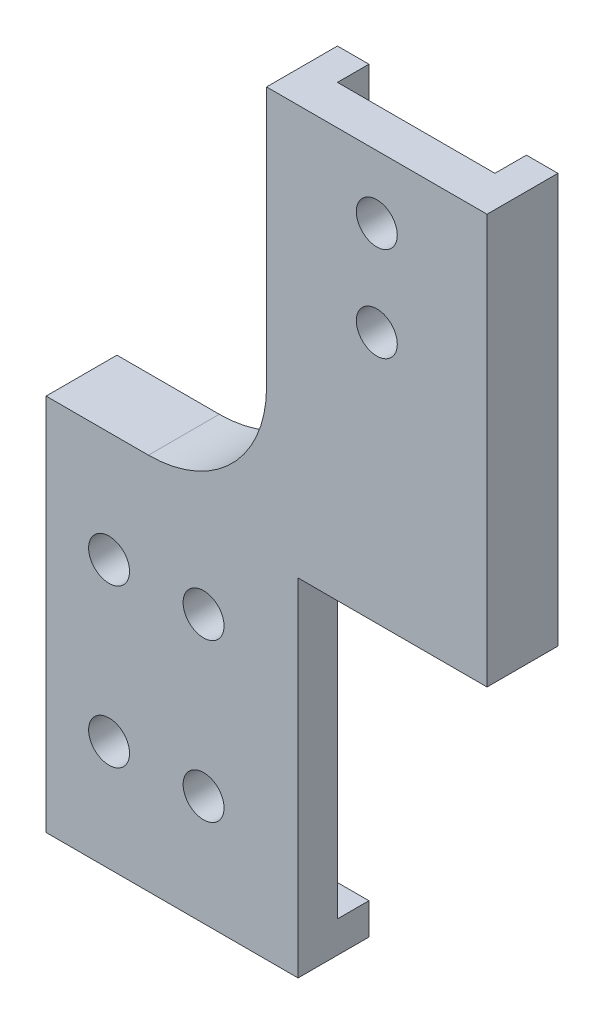
ISO-10303-21;
HEADER;
FILE_DESCRIPTION(('STEP AP214'),'2;1');
FILE_NAME('part.step','',(''),(''),'','','');
FILE_SCHEMA(('AUTOMOTIVE_DESIGN { 1 0 10303 214 1 1 1 1 }'));
ENDSEC;
DATA;
#1=APPLICATION_CONTEXT('core data for automotive mechanical design processes');
#2=APPLICATION_PROTOCOL_DEFINITION('international standard','automotive_design',2000,#1);
#3=PRODUCT_CONTEXT('',#1,'mechanical');
#4=PRODUCT('Part','Part','',(#3));
#5=PRODUCT_RELATED_PRODUCT_CATEGORY('part','',(#4));
#6=PRODUCT_DEFINITION_FORMATION('','',#4);
#7=PRODUCT_DEFINITION_CONTEXT('part definition',#1,'design');
#8=PRODUCT_DEFINITION('design','',#6,#7);
#9=PRODUCT_DEFINITION_SHAPE('','',#8);
#10=(LENGTH_UNIT() NAMED_UNIT(*) SI_UNIT(.MILLI.,.METRE.));
#11=(NAMED_UNIT(*) PLANE_ANGLE_UNIT() SI_UNIT($,.RADIAN.));
#12=(NAMED_UNIT(*) SI_UNIT($,.STERADIAN.) SOLID_ANGLE_UNIT());
#13=UNCERTAINTY_MEASURE_WITH_UNIT(LENGTH_MEASURE(1.E-05),#10,'distance_accuracy_value','');
#14=(GEOMETRIC_REPRESENTATION_CONTEXT(3) GLOBAL_UNCERTAINTY_ASSIGNED_CONTEXT((#13)) GLOBAL_UNIT_ASSIGNED_CONTEXT((#10,
#11,#12)) REPRESENTATION_CONTEXT('',''));
#15=CARTESIAN_POINT('',(0.,0.,0.));
#16=DIRECTION('',(0.,0.,1.));
#17=DIRECTION('',(1.,0.,0.));
#18=AXIS2_PLACEMENT_3D('',#15,#16,#17);
#19=CARTESIAN_POINT('',(0.,0.,0.));
#20=DIRECTION('',(0.,0.,1.));
#21=DIRECTION('',(1.,0.,0.));
#22=AXIS2_PLACEMENT_3D('',#19,#20,#21);
#23=PLANE('',#22);
#24=CARTESIAN_POINT('',(-19.1632335340545,-2.51071338522602,0.));
#25=DIRECTION('',(0.,0.,1.));
#26=DIRECTION('',(1.,0.,0.));
#27=AXIS2_PLACEMENT_3D('',#24,#25,#26);
#28=CIRCLE('',#27,2.6);
#29=CARTESIAN_POINT('',(-16.5632335340545,-2.51071338522602,0.));
#30=VERTEX_POINT('',#29);
#31=EDGE_CURVE('E219',#30,#30,#28,.T.);
#32=ORIENTED_EDGE('',*,*,#31,.T.);
#33=EDGE_LOOP('',(#32));
#34=FACE_BOUND('',#33,.T.);
#35=CARTESIAN_POINT('',(-31.1632335340545,-2.51071338522602,0.));
#36=DIRECTION('',(0.,0.,1.));
#37=DIRECTION('',(1.,0.,0.));
#38=AXIS2_PLACEMENT_3D('',#35,#36,#37);
#39=CIRCLE('',#38,2.6);
#40=CARTESIAN_POINT('',(-28.5632335340545,-2.51071338522602,0.));
#41=VERTEX_POINT('',#40);
#42=EDGE_CURVE('E258',#41,#41,#39,.T.);
#43=ORIENTED_EDGE('',*,*,#42,.T.);
#44=EDGE_LOOP('',(#43));
#45=FACE_BOUND('',#44,.T.);
#46=CARTESIAN_POINT('',(-19.1632335340545,-22.510713385226,0.));
#47=DIRECTION('',(0.,0.,1.));
#48=DIRECTION('',(1.,0.,0.));
#49=AXIS2_PLACEMENT_3D('',#46,#47,#48);
#50=CIRCLE('',#49,2.6);
#51=CARTESIAN_POINT('',(-16.5632335340545,-22.510713385226,0.));
#52=VERTEX_POINT('',#51);
#53=EDGE_CURVE('E267',#52,#52,#50,.T.);
#54=ORIENTED_EDGE('',*,*,#53,.T.);
#55=EDGE_LOOP('',(#54));
#56=FACE_BOUND('',#55,.T.);
#57=CARTESIAN_POINT('',(-31.1632335340545,-22.510713385226,0.));
#58=DIRECTION('',(0.,0.,1.));
#59=DIRECTION('',(1.,0.,0.));
#60=AXIS2_PLACEMENT_3D('',#57,#58,#59);
#61=CIRCLE('',#60,2.6);
#62=CARTESIAN_POINT('',(-28.5632335340545,-22.510713385226,0.));
#63=VERTEX_POINT('',#62);
#64=EDGE_CURVE('E270',#63,#63,#61,.T.);
#65=ORIENTED_EDGE('',*,*,#64,.T.);
#66=EDGE_LOOP('',(#65));
#67=FACE_BOUND('',#66,.T.);
#68=DIRECTION('',(1.,0.,0.));
#69=VECTOR('',#68,1.);
#70=CARTESIAN_POINT('',(0.,-32.510713385226,0.));
#71=LINE('',#70,#69);
#72=CARTESIAN_POINT('',(-39.1632335340545,-32.510713385226,0.));
#73=VERTEX_POINT('',#72);
#74=CARTESIAN_POINT('',(-7.16323353405451,-32.510713385226,0.));
#75=VERTEX_POINT('',#74);
#76=EDGE_CURVE('E164',#73,#75,#71,.T.);
#77=ORIENTED_EDGE('',*,*,#76,.F.);
#78=DIRECTION('',(0.,-1.,0.));
#79=VECTOR('',#78,1.);
#80=CARTESIAN_POINT('',(-39.1632335340545,0.,0.));
#81=LINE('',#80,#79);
#82=CARTESIAN_POINT('',(-39.1632335340545,7.48928661477399,0.));
#83=VERTEX_POINT('',#82);
#84=EDGE_CURVE('E170',#83,#73,#81,.T.);
#85=ORIENTED_EDGE('',*,*,#84,.F.);
#86=DIRECTION('',(-1.,0.,0.));
#87=VECTOR('',#86,1.);
#88=CARTESIAN_POINT('',(0.,7.48928661477399,0.));
#89=LINE('',#88,#87);
#90=CARTESIAN_POINT('',(-7.16323353405451,7.48928661477399,0.));
#91=VERTEX_POINT('',#90);
#92=EDGE_CURVE('E174',#91,#83,#89,.T.);
#93=ORIENTED_EDGE('',*,*,#92,.F.);
#94=DIRECTION('',(0.,1.,0.));
#95=VECTOR('',#94,1.);
#96=CARTESIAN_POINT('',(-7.16323353405451,0.,0.));
#97=LINE('',#96,#95);
#98=EDGE_CURVE('E273',#75,#91,#97,.T.);
#99=ORIENTED_EDGE('',*,*,#98,.F.);
#100=EDGE_LOOP('',(#77,#85,#93,#99));
#101=FACE_BOUND('',#100,.T.);
#102=ADVANCED_FACE('F35',(#34,#45,#56,#67,#101),#23,.F.);
#103=CARTESIAN_POINT('',(2.83676646594549,51.489286614774,0.));
#104=DIRECTION('',(0.,0.,1.));
#105=DIRECTION('',(1.,0.,0.));
#106=AXIS2_PLACEMENT_3D('',#103,#104,#105);
#107=CIRCLE('',#106,2.6);
#108=CARTESIAN_POINT('',(5.43676646594549,51.489286614774,0.));
#109=VERTEX_POINT('',#108);
#110=EDGE_CURVE('E264',#109,#109,#107,.T.);
#111=ORIENTED_EDGE('',*,*,#110,.T.);
#112=EDGE_LOOP('',(#111));
#113=FACE_BOUND('',#112,.T.);
#114=CARTESIAN_POINT('',(2.83676646594549,39.489286614774,0.));
#115=DIRECTION('',(0.,0.,1.));
#116=DIRECTION('',(1.,0.,0.));
#117=AXIS2_PLACEMENT_3D('',#114,#115,#116);
#118=CIRCLE('',#117,2.6);
#119=CARTESIAN_POINT('',(5.43676646594549,39.489286614774,0.));
#120=VERTEX_POINT('',#119);
#121=EDGE_CURVE('E261',#120,#120,#118,.T.);
#122=ORIENTED_EDGE('',*,*,#121,.T.);
#123=EDGE_LOOP('',(#122));
#124=FACE_BOUND('',#123,.T.);
#125=DIRECTION('',(0.,-1.,0.));
#126=VECTOR('',#125,1.);
#127=CARTESIAN_POINT('',(-7.16323353405453,0.,0.));
#128=LINE('',#127,#126);
#129=CARTESIAN_POINT('',(-7.16323353405451,59.489286614774,0.));
#130=VERTEX_POINT('',#129);
#131=EDGE_CURVE('E171',#130,#91,#128,.T.);
#132=ORIENTED_EDGE('',*,*,#131,.F.);
#133=DIRECTION('',(-1.,0.,0.));
#134=VECTOR('',#133,1.);
#135=CARTESIAN_POINT('',(0.,59.489286614774,0.));
#136=LINE('',#135,#134);
#137=CARTESIAN_POINT('',(12.8367664659455,59.489286614774,0.));
#138=VERTEX_POINT('',#137);
#139=EDGE_CURVE('E278',#138,#130,#136,.T.);
#140=ORIENTED_EDGE('',*,*,#139,.F.);
#141=DIRECTION('',(0.,-1.,0.));
#142=VECTOR('',#141,1.);
#143=CARTESIAN_POINT('',(12.8367664659455,0.,0.));
#144=LINE('',#143,#142);
#145=CARTESIAN_POINT('',(12.8367664659455,7.48928661477399,0.));
#146=VERTEX_POINT('',#145);
#147=EDGE_CURVE('E201',#138,#146,#144,.T.);
#148=ORIENTED_EDGE('',*,*,#147,.T.);
#149=DIRECTION('',(1.,0.,0.));
#150=VECTOR('',#149,1.);
#151=CARTESIAN_POINT('',(0.,7.48928661477399,0.));
#152=LINE('',#151,#150);
#153=EDGE_CURVE('E275',#91,#146,#152,.T.);
#154=ORIENTED_EDGE('',*,*,#153,.F.);
#155=EDGE_LOOP('',(#132,#140,#148,#154));
#156=FACE_BOUND('',#155,.T.);
#157=ADVANCED_FACE('F322',(#113,#124,#156),#23,.F.);
#158=CARTESIAN_POINT('',(-7.16323353405451,0.,5.));
#159=DIRECTION('',(-1.,0.,0.));
#160=DIRECTION('',(0.,-1.,0.));
#161=AXIS2_PLACEMENT_3D('',#158,#159,#160);
#162=PLANE('',#161);
#163=DIRECTION('',(0.,0.,-1.));
#164=VECTOR('',#163,1.);
#165=CARTESIAN_POINT('',(-7.16323353405451,-36.510713385226,5.));
#166=LINE('',#165,#164);
#167=CARTESIAN_POINT('',(-7.16323353405451,-36.510713385226,5.));
#168=VERTEX_POINT('',#167);
#169=CARTESIAN_POINT('',(-7.16323353405451,-36.510713385226,-4.));
#170=VERTEX_POINT('',#169);
#171=EDGE_CURVE('E255',#168,#170,#166,.T.);
#172=ORIENTED_EDGE('',*,*,#171,.T.);
#173=DIRECTION('',(0.,-1.,0.));
#174=VECTOR('',#173,1.);
#175=CARTESIAN_POINT('',(-7.16323353405451,0.,-4.));
#176=LINE('',#175,#174);
#177=CARTESIAN_POINT('',(-7.16323353405451,-32.510713385226,-4.));
#178=VERTEX_POINT('',#177);
#179=EDGE_CURVE('E154',#178,#170,#176,.T.);
#180=ORIENTED_EDGE('',*,*,#179,.F.);
#181=DIRECTION('',(0.,0.,1.));
#182=VECTOR('',#181,1.);
#183=CARTESIAN_POINT('',(-7.16323353405451,-32.510713385226,-4.));
#184=LINE('',#183,#182);
#185=EDGE_CURVE('E150',#178,#75,#184,.T.);
#186=ORIENTED_EDGE('',*,*,#185,.T.);
#187=ORIENTED_EDGE('',*,*,#98,.T.);
#188=DIRECTION('',(0.,0.,-1.));
#189=VECTOR('',#188,1.);
#190=CARTESIAN_POINT('',(-7.16323353405451,7.48928661477399,5.));
#191=LINE('',#190,#189);
#192=CARTESIAN_POINT('',(-7.16323353405451,7.48928661477399,5.));
#193=VERTEX_POINT('',#192);
#194=EDGE_CURVE('E294',#193,#91,#191,.T.);
#195=ORIENTED_EDGE('',*,*,#194,.F.);
#196=DIRECTION('',(0.,1.,0.));
#197=VECTOR('',#196,1.);
#198=CARTESIAN_POINT('',(-7.16323353405451,0.,5.));
#199=LINE('',#198,#197);
#200=EDGE_CURVE('E238',#168,#193,#199,.T.);
#201=ORIENTED_EDGE('',*,*,#200,.F.);
#202=EDGE_LOOP('',(#172,#180,#186,#187,#195,#201));
#203=FACE_BOUND('',#202,.T.);
#204=ADVANCED_FACE('F328',(#203),#162,.F.);
#205=CARTESIAN_POINT('',(0.,7.48928661477399,5.));
#206=DIRECTION('',(0.,1.,0.));
#207=DIRECTION('',(0.,0.,1.));
#208=AXIS2_PLACEMENT_3D('',#205,#206,#207);
#209=PLANE('',#208);
#210=ORIENTED_EDGE('',*,*,#153,.T.);
#211=DIRECTION('',(0.,0.,1.));
#212=VECTOR('',#211,1.);
#213=CARTESIAN_POINT('',(12.8367664659455,7.48928661477399,-4.));
#214=LINE('',#213,#212);
#215=CARTESIAN_POINT('',(12.8367664659455,7.48928661477399,-4.));
#216=VERTEX_POINT('',#215);
#217=EDGE_CURVE('E213',#216,#146,#214,.T.);
#218=ORIENTED_EDGE('',*,*,#217,.F.);
#219=DIRECTION('',(-1.,0.,0.));
#220=VECTOR('',#219,1.);
#221=CARTESIAN_POINT('',(0.,7.48928661477399,-4.));
#222=LINE('',#221,#220);
#223=CARTESIAN_POINT('',(16.8367664659455,7.48928661477399,-4.));
#224=VERTEX_POINT('',#223);
#225=EDGE_CURVE('E211',#224,#216,#222,.T.);
#226=ORIENTED_EDGE('',*,*,#225,.F.);
#227=DIRECTION('',(0.,0.,-1.));
#228=VECTOR('',#227,1.);
#229=CARTESIAN_POINT('',(16.8367664659455,7.48928661477399,5.));
#230=LINE('',#229,#228);
#231=CARTESIAN_POINT('',(16.8367664659455,7.48928661477399,5.));
#232=VERTEX_POINT('',#231);
#233=EDGE_CURVE('E292',#232,#224,#230,.T.);
#234=ORIENTED_EDGE('',*,*,#233,.F.);
#235=DIRECTION('',(1.,0.,0.));
#236=VECTOR('',#235,1.);
#237=CARTESIAN_POINT('',(0.,7.48928661477399,5.));
#238=LINE('',#237,#236);
#239=EDGE_CURVE('E241',#193,#232,#238,.T.);
#240=ORIENTED_EDGE('',*,*,#239,.F.);
#241=ORIENTED_EDGE('',*,*,#194,.T.);
#242=EDGE_LOOP('',(#210,#218,#226,#234,#240,#241));
#243=FACE_BOUND('',#242,.T.);
#244=ADVANCED_FACE('F354',(#243),#209,.F.);
#245=CARTESIAN_POINT('',(16.8367664659455,0.,5.));
#246=DIRECTION('',(-1.,0.,0.));
#247=DIRECTION('',(0.,-1.,0.));
#248=AXIS2_PLACEMENT_3D('',#245,#246,#247);
#249=PLANE('',#248);
#250=ORIENTED_EDGE('',*,*,#233,.T.);
#251=DIRECTION('',(0.,-1.,0.));
#252=VECTOR('',#251,1.);
#253=CARTESIAN_POINT('',(16.8367664659455,0.,-4.));
#254=LINE('',#253,#252);
#255=CARTESIAN_POINT('',(16.8367664659455,59.489286614774,-4.));
#256=VERTEX_POINT('',#255);
#257=EDGE_CURVE('E208',#256,#224,#254,.T.);
#258=ORIENTED_EDGE('',*,*,#257,.F.);
#259=DIRECTION('',(0.,0.,-1.));
#260=VECTOR('',#259,1.);
#261=CARTESIAN_POINT('',(16.8367664659455,59.489286614774,5.));
#262=LINE('',#261,#260);
#263=CARTESIAN_POINT('',(16.8367664659455,59.489286614774,5.));
#264=VERTEX_POINT('',#263);
#265=EDGE_CURVE('E290',#264,#256,#262,.T.);
#266=ORIENTED_EDGE('',*,*,#265,.F.);
#267=DIRECTION('',(0.,1.,0.));
#268=VECTOR('',#267,1.);
#269=CARTESIAN_POINT('',(16.8367664659455,0.,5.));
#270=LINE('',#269,#268);
#271=EDGE_CURVE('E243',#232,#264,#270,.T.);
#272=ORIENTED_EDGE('',*,*,#271,.F.);
#273=EDGE_LOOP('',(#250,#258,#266,#272));
#274=FACE_BOUND('',#273,.T.);
#275=ADVANCED_FACE('F350',(#274),#249,.F.);
#276=CARTESIAN_POINT('',(0.,59.489286614774,5.));
#277=DIRECTION('',(0.,-1.,0.));
#278=DIRECTION('',(0.,0.,-1.));
#279=AXIS2_PLACEMENT_3D('',#276,#277,#278);
#280=PLANE('',#279);
#281=ORIENTED_EDGE('',*,*,#265,.T.);
#282=DIRECTION('',(1.,0.,0.));
#283=VECTOR('',#282,1.);
#284=CARTESIAN_POINT('',(0.,59.489286614774,-4.));
#285=LINE('',#284,#283);
#286=CARTESIAN_POINT('',(12.8367664659455,59.489286614774,-4.));
#287=VERTEX_POINT('',#286);
#288=EDGE_CURVE('E205',#287,#256,#285,.T.);
#289=ORIENTED_EDGE('',*,*,#288,.F.);
#290=DIRECTION('',(0.,0.,1.));
#291=VECTOR('',#290,1.);
#292=CARTESIAN_POINT('',(12.8367664659455,59.489286614774,-4.));
#293=LINE('',#292,#291);
#294=EDGE_CURVE('E217',#287,#138,#293,.T.);
#295=ORIENTED_EDGE('',*,*,#294,.T.);
#296=ORIENTED_EDGE('',*,*,#139,.T.);
#297=DIRECTION('',(0.,0.,1.));
#298=VECTOR('',#297,1.);
#299=CARTESIAN_POINT('',(-7.16323353405451,59.489286614774,-4.));
#300=LINE('',#299,#298);
#301=CARTESIAN_POINT('',(-7.16323353405451,59.489286614774,-4.));
#302=VERTEX_POINT('',#301);
#303=EDGE_CURVE('E192',#302,#130,#300,.T.);
#304=ORIENTED_EDGE('',*,*,#303,.F.);
#305=DIRECTION('',(1.,0.,0.));
#306=VECTOR('',#305,1.);
#307=CARTESIAN_POINT('',(0.,59.489286614774,-4.));
#308=LINE('',#307,#306);
#309=CARTESIAN_POINT('',(-11.1632335340545,59.489286614774,-4.));
#310=VERTEX_POINT('',#309);
#311=EDGE_CURVE('E191',#310,#302,#308,.T.);
#312=ORIENTED_EDGE('',*,*,#311,.F.);
#313=DIRECTION('',(0.,0.,-1.));
#314=VECTOR('',#313,1.);
#315=CARTESIAN_POINT('',(-11.1632335340545,59.489286614774,5.));
#316=LINE('',#315,#314);
#317=CARTESIAN_POINT('',(-11.1632335340545,59.489286614774,5.));
#318=VERTEX_POINT('',#317);
#319=EDGE_CURVE('E287',#318,#310,#316,.T.);
#320=ORIENTED_EDGE('',*,*,#319,.F.);
#321=DIRECTION('',(-1.,0.,0.));
#322=VECTOR('',#321,1.);
#323=CARTESIAN_POINT('',(0.,59.489286614774,5.));
#324=LINE('',#323,#322);
#325=EDGE_CURVE('E245',#264,#318,#324,.T.);
#326=ORIENTED_EDGE('',*,*,#325,.F.);
#327=EDGE_LOOP('',(#281,#289,#295,#296,#304,#312,#320,#326));
#328=FACE_BOUND('',#327,.T.);
#329=ADVANCED_FACE('F347',(#328),#280,.F.);
#330=CARTESIAN_POINT('',(-11.1632335340545,0.,5.));
#331=DIRECTION('',(1.,0.,0.));
#332=DIRECTION('',(0.,1.,0.));
#333=AXIS2_PLACEMENT_3D('',#330,#331,#332);
#334=PLANE('',#333);
#335=DIRECTION('',(0.,1.,0.));
#336=VECTOR('',#335,1.);
#337=CARTESIAN_POINT('',(-11.1632335340545,0.,-4.));
#338=LINE('',#337,#336);
#339=CARTESIAN_POINT('',(-11.1632335340545,26.489286614774,-4.));
#340=VERTEX_POINT('',#339);
#341=EDGE_CURVE('E189',#340,#310,#338,.T.);
#342=ORIENTED_EDGE('',*,*,#341,.F.);
#343=DIRECTION('',(0.,0.,-1.));
#344=VECTOR('',#343,1.);
#345=CARTESIAN_POINT('',(-11.1632335340545,26.489286614774,5.));
#346=LINE('',#345,#344);
#347=CARTESIAN_POINT('',(-11.1632335340545,26.489286614774,5.));
#348=VERTEX_POINT('',#347);
#349=EDGE_CURVE('E50',#340,#348,#346,.F.);
#350=ORIENTED_EDGE('',*,*,#349,.T.);
#351=DIRECTION('',(0.,-1.,0.));
#352=VECTOR('',#351,1.);
#353=CARTESIAN_POINT('',(-11.1632335340545,0.,5.));
#354=LINE('',#353,#352);
#355=EDGE_CURVE('E247',#318,#348,#354,.T.);
#356=ORIENTED_EDGE('',*,*,#355,.F.);
#357=ORIENTED_EDGE('',*,*,#319,.T.);
#358=EDGE_LOOP('',(#342,#350,#356,#357));
#359=FACE_BOUND('',#358,.T.);
#360=ADVANCED_FACE('F344',(#359),#334,.F.);
#361=CARTESIAN_POINT('',(0.,11.489286614774,5.));
#362=DIRECTION('',(0.,-1.,0.));
#363=DIRECTION('',(1.,0.,0.));
#364=AXIS2_PLACEMENT_3D('',#361,#362,#363);
#365=PLANE('',#364);
#366=DIRECTION('',(-1.,0.,0.));
#367=VECTOR('',#366,1.);
#368=CARTESIAN_POINT('',(0.,11.489286614774,5.));
#369=LINE('',#368,#367);
#370=CARTESIAN_POINT('',(-26.1632335340545,11.489286614774,5.));
#371=VERTEX_POINT('',#370);
#372=CARTESIAN_POINT('',(-39.1632335340545,11.489286614774,5.));
#373=VERTEX_POINT('',#372);
#374=EDGE_CURVE('E249',#371,#373,#369,.T.);
#375=ORIENTED_EDGE('',*,*,#374,.F.);
#376=DIRECTION('',(0.,0.,-1.));
#377=VECTOR('',#376,1.);
#378=CARTESIAN_POINT('',(-26.1632335340545,11.489286614774,-4.));
#379=LINE('',#378,#377);
#380=CARTESIAN_POINT('',(-26.1632335340545,11.489286614774,-4.));
#381=VERTEX_POINT('',#380);
#382=EDGE_CURVE('E297',#371,#381,#379,.T.);
#383=ORIENTED_EDGE('',*,*,#382,.T.);
#384=DIRECTION('',(1.,0.,0.));
#385=VECTOR('',#384,1.);
#386=CARTESIAN_POINT('',(0.,11.489286614774,-4.));
#387=LINE('',#386,#385);
#388=CARTESIAN_POINT('',(-39.1632335340545,11.489286614774,-4.));
#389=VERTEX_POINT('',#388);
#390=EDGE_CURVE('E187',#389,#381,#387,.T.);
#391=ORIENTED_EDGE('',*,*,#390,.F.);
#392=DIRECTION('',(0.,0.,-1.));
#393=VECTOR('',#392,1.);
#394=CARTESIAN_POINT('',(-39.1632335340545,11.489286614774,5.));
#395=LINE('',#394,#393);
#396=EDGE_CURVE('E285',#373,#389,#395,.T.);
#397=ORIENTED_EDGE('',*,*,#396,.F.);
#398=EDGE_LOOP('',(#375,#383,#391,#397));
#399=FACE_BOUND('',#398,.T.);
#400=ADVANCED_FACE('F304',(#399),#365,.F.);
#401=CARTESIAN_POINT('',(-39.1632335340545,0.,5.));
#402=DIRECTION('',(1.,0.,0.));
#403=DIRECTION('',(0.,1.,0.));
#404=AXIS2_PLACEMENT_3D('',#401,#402,#403);
#405=PLANE('',#404);
#406=ORIENTED_EDGE('',*,*,#396,.T.);
#407=DIRECTION('',(0.,1.,0.));
#408=VECTOR('',#407,1.);
#409=CARTESIAN_POINT('',(-39.1632335340545,0.,-4.));
#410=LINE('',#409,#408);
#411=CARTESIAN_POINT('',(-39.1632335340545,7.48928661477399,-4.));
#412=VERTEX_POINT('',#411);
#413=EDGE_CURVE('E184',#412,#389,#410,.T.);
#414=ORIENTED_EDGE('',*,*,#413,.F.);
#415=DIRECTION('',(0.,0.,1.));
#416=VECTOR('',#415,1.);
#417=CARTESIAN_POINT('',(-39.1632335340545,7.48928661477399,-4.));
#418=LINE('',#417,#416);
#419=EDGE_CURVE('E196',#412,#83,#418,.T.);
#420=ORIENTED_EDGE('',*,*,#419,.T.);
#421=ORIENTED_EDGE('',*,*,#84,.T.);
#422=DIRECTION('',(0.,0.,1.));
#423=VECTOR('',#422,1.);
#424=CARTESIAN_POINT('',(-39.1632335340545,-32.510713385226,-4.));
#425=LINE('',#424,#423);
#426=CARTESIAN_POINT('',(-39.1632335340545,-32.510713385226,-4.));
#427=VERTEX_POINT('',#426);
#428=EDGE_CURVE('E147',#427,#73,#425,.T.);
#429=ORIENTED_EDGE('',*,*,#428,.F.);
#430=DIRECTION('',(0.,1.,0.));
#431=VECTOR('',#430,1.);
#432=CARTESIAN_POINT('',(-39.1632335340545,0.,-4.));
#433=LINE('',#432,#431);
#434=CARTESIAN_POINT('',(-39.1632335340545,-36.510713385226,-4.));
#435=VERTEX_POINT('',#434);
#436=EDGE_CURVE('E155',#435,#427,#433,.T.);
#437=ORIENTED_EDGE('',*,*,#436,.F.);
#438=DIRECTION('',(0.,0.,-1.));
#439=VECTOR('',#438,1.);
#440=CARTESIAN_POINT('',(-39.1632335340545,-36.510713385226,5.));
#441=LINE('',#440,#439);
#442=CARTESIAN_POINT('',(-39.1632335340545,-36.510713385226,5.));
#443=VERTEX_POINT('',#442);
#444=EDGE_CURVE('E283',#443,#435,#441,.T.);
#445=ORIENTED_EDGE('',*,*,#444,.F.);
#446=DIRECTION('',(0.,-1.,0.));
#447=VECTOR('',#446,1.);
#448=CARTESIAN_POINT('',(-39.1632335340545,0.,5.));
#449=LINE('',#448,#447);
#450=EDGE_CURVE('E251',#373,#443,#449,.T.);
#451=ORIENTED_EDGE('',*,*,#450,.F.);
#452=EDGE_LOOP('',(#406,#414,#420,#421,#429,#437,#445,#451));
#453=FACE_BOUND('',#452,.T.);
#454=ADVANCED_FACE('F167',(#453),#405,.F.);
#455=CARTESIAN_POINT('',(-31.1632335340545,-22.510713385226,5.));
#456=DIRECTION('',(0.,0.,-1.));
#457=DIRECTION('',(-1.,0.,0.));
#458=AXIS2_PLACEMENT_3D('',#455,#456,#457);
#459=CYLINDRICAL_SURFACE('',#458,2.6);
#460=CARTESIAN_POINT('',(-31.1632335340545,-22.510713385226,5.));
#461=DIRECTION('',(0.,0.,1.));
#462=DIRECTION('',(1.,0.,0.));
#463=AXIS2_PLACEMENT_3D('',#460,#461,#462);
#464=CIRCLE('',#463,2.6);
#465=CARTESIAN_POINT('',(-28.5632335340545,-22.510713385226,5.));
#466=VERTEX_POINT('',#465);
#467=EDGE_CURVE('E235',#466,#466,#464,.T.);
#468=ORIENTED_EDGE('',*,*,#467,.T.);
#469=EDGE_LOOP('',(#468));
#470=FACE_BOUND('',#469,.T.);
#471=ORIENTED_EDGE('',*,*,#64,.F.);
#472=EDGE_LOOP('',(#471));
#473=FACE_BOUND('',#472,.T.);
#474=ADVANCED_FACE('F341',(#470,#473),#459,.F.);
#475=CARTESIAN_POINT('',(-19.1632335340545,-22.510713385226,5.));
#476=DIRECTION('',(0.,0.,-1.));
#477=DIRECTION('',(-1.,0.,0.));
#478=AXIS2_PLACEMENT_3D('',#475,#476,#477);
#479=CYLINDRICAL_SURFACE('',#478,2.6);
#480=CARTESIAN_POINT('',(-19.1632335340545,-22.510713385226,5.));
#481=DIRECTION('',(0.,0.,1.));
#482=DIRECTION('',(1.,0.,0.));
#483=AXIS2_PLACEMENT_3D('',#480,#481,#482);
#484=CIRCLE('',#483,2.6);
#485=CARTESIAN_POINT('',(-16.5632335340545,-22.510713385226,5.));
#486=VERTEX_POINT('',#485);
#487=EDGE_CURVE('E232',#486,#486,#484,.T.);
#488=ORIENTED_EDGE('',*,*,#487,.T.);
#489=EDGE_LOOP('',(#488));
#490=FACE_BOUND('',#489,.T.);
#491=ORIENTED_EDGE('',*,*,#53,.F.);
#492=EDGE_LOOP('',(#491));
#493=FACE_BOUND('',#492,.T.);
#494=ADVANCED_FACE('F364',(#490,#493),#479,.F.);
#495=CARTESIAN_POINT('',(2.83676646594549,51.489286614774,5.));
#496=DIRECTION('',(0.,0.,-1.));
#497=DIRECTION('',(-1.,0.,0.));
#498=AXIS2_PLACEMENT_3D('',#495,#496,#497);
#499=CYLINDRICAL_SURFACE('',#498,2.6);
#500=CARTESIAN_POINT('',(2.83676646594549,51.489286614774,5.));
#501=DIRECTION('',(0.,0.,1.));
#502=DIRECTION('',(1.,0.,0.));
#503=AXIS2_PLACEMENT_3D('',#500,#501,#502);
#504=CIRCLE('',#503,2.6);
#505=CARTESIAN_POINT('',(5.43676646594549,51.489286614774,5.));
#506=VERTEX_POINT('',#505);
#507=EDGE_CURVE('E229',#506,#506,#504,.T.);
#508=ORIENTED_EDGE('',*,*,#507,.T.);
#509=EDGE_LOOP('',(#508));
#510=FACE_BOUND('',#509,.T.);
#511=ORIENTED_EDGE('',*,*,#110,.F.);
#512=EDGE_LOOP('',(#511));
#513=FACE_BOUND('',#512,.T.);
#514=ADVANCED_FACE('F368',(#510,#513),#499,.F.);
#515=CARTESIAN_POINT('',(2.83676646594549,39.489286614774,5.));
#516=DIRECTION('',(0.,0.,-1.));
#517=DIRECTION('',(-1.,0.,0.));
#518=AXIS2_PLACEMENT_3D('',#515,#516,#517);
#519=CYLINDRICAL_SURFACE('',#518,2.6);
#520=CARTESIAN_POINT('',(2.83676646594549,39.489286614774,5.));
#521=DIRECTION('',(0.,0.,1.));
#522=DIRECTION('',(1.,0.,0.));
#523=AXIS2_PLACEMENT_3D('',#520,#521,#522);
#524=CIRCLE('',#523,2.6);
#525=CARTESIAN_POINT('',(5.43676646594549,39.489286614774,5.));
#526=VERTEX_POINT('',#525);
#527=EDGE_CURVE('E226',#526,#526,#524,.T.);
#528=ORIENTED_EDGE('',*,*,#527,.T.);
#529=EDGE_LOOP('',(#528));
#530=FACE_BOUND('',#529,.T.);
#531=ORIENTED_EDGE('',*,*,#121,.F.);
#532=EDGE_LOOP('',(#531));
#533=FACE_BOUND('',#532,.T.);
#534=ADVANCED_FACE('F372',(#530,#533),#519,.F.);
#535=CARTESIAN_POINT('',(-31.1632335340545,-2.51071338522602,5.));
#536=DIRECTION('',(0.,0.,-1.));
#537=DIRECTION('',(-1.,0.,0.));
#538=AXIS2_PLACEMENT_3D('',#535,#536,#537);
#539=CYLINDRICAL_SURFACE('',#538,2.6);
#540=CARTESIAN_POINT('',(-31.1632335340545,-2.51071338522602,5.));
#541=DIRECTION('',(0.,0.,1.));
#542=DIRECTION('',(1.,0.,0.));
#543=AXIS2_PLACEMENT_3D('',#540,#541,#542);
#544=CIRCLE('',#543,2.6);
#545=CARTESIAN_POINT('',(-28.5632335340545,-2.51071338522602,5.));
#546=VERTEX_POINT('',#545);
#547=EDGE_CURVE('E223',#546,#546,#544,.T.);
#548=ORIENTED_EDGE('',*,*,#547,.T.);
#549=EDGE_LOOP('',(#548));
#550=FACE_BOUND('',#549,.T.);
#551=ORIENTED_EDGE('',*,*,#42,.F.);
#552=EDGE_LOOP('',(#551));
#553=FACE_BOUND('',#552,.T.);
#554=ADVANCED_FACE('F376',(#550,#553),#539,.F.);
#555=CARTESIAN_POINT('',(-19.1632335340545,-2.51071338522602,5.));
#556=DIRECTION('',(0.,0.,-1.));
#557=DIRECTION('',(-1.,0.,0.));
#558=AXIS2_PLACEMENT_3D('',#555,#556,#557);
#559=CYLINDRICAL_SURFACE('',#558,2.6);
#560=CARTESIAN_POINT('',(-19.1632335340545,-2.51071338522602,5.));
#561=DIRECTION('',(0.,0.,1.));
#562=DIRECTION('',(1.,0.,0.));
#563=AXIS2_PLACEMENT_3D('',#560,#561,#562);
#564=CIRCLE('',#563,2.6);
#565=CARTESIAN_POINT('',(-16.5632335340545,-2.51071338522602,5.));
#566=VERTEX_POINT('',#565);
#567=EDGE_CURVE('E220',#566,#566,#564,.T.);
#568=ORIENTED_EDGE('',*,*,#567,.T.);
#569=EDGE_LOOP('',(#568));
#570=FACE_BOUND('',#569,.T.);
#571=ORIENTED_EDGE('',*,*,#31,.F.);
#572=EDGE_LOOP('',(#571));
#573=FACE_BOUND('',#572,.T.);
#574=ADVANCED_FACE('F337',(#570,#573),#559,.F.);
#575=CARTESIAN_POINT('',(0.,-36.510713385226,5.));
#576=DIRECTION('',(0.,1.,0.));
#577=DIRECTION('',(-1.,0.,0.));
#578=AXIS2_PLACEMENT_3D('',#575,#576,#577);
#579=PLANE('',#578);
#580=ORIENTED_EDGE('',*,*,#444,.T.);
#581=DIRECTION('',(-1.,0.,0.));
#582=VECTOR('',#581,1.);
#583=CARTESIAN_POINT('',(0.,-36.510713385226,-4.));
#584=LINE('',#583,#582);
#585=EDGE_CURVE('E161',#170,#435,#584,.T.);
#586=ORIENTED_EDGE('',*,*,#585,.F.);
#587=ORIENTED_EDGE('',*,*,#171,.F.);
#588=DIRECTION('',(1.,0.,0.));
#589=VECTOR('',#588,1.);
#590=CARTESIAN_POINT('',(0.,-36.510713385226,5.));
#591=LINE('',#590,#589);
#592=EDGE_CURVE('E253',#443,#168,#591,.T.);
#593=ORIENTED_EDGE('',*,*,#592,.F.);
#594=EDGE_LOOP('',(#580,#586,#587,#593));
#595=FACE_BOUND('',#594,.T.);
#596=ADVANCED_FACE('F334',(#595),#579,.F.);
#597=CARTESIAN_POINT('',(0.,0.,5.));
#598=DIRECTION('',(0.,0.,1.));
#599=DIRECTION('',(1.,0.,0.));
#600=AXIS2_PLACEMENT_3D('',#597,#598,#599);
#601=PLANE('',#600);
#602=ORIENTED_EDGE('',*,*,#567,.F.);
#603=EDGE_LOOP('',(#602));
#604=FACE_BOUND('',#603,.T.);
#605=ORIENTED_EDGE('',*,*,#547,.F.);
#606=EDGE_LOOP('',(#605));
#607=FACE_BOUND('',#606,.T.);
#608=ORIENTED_EDGE('',*,*,#527,.F.);
#609=EDGE_LOOP('',(#608));
#610=FACE_BOUND('',#609,.T.);
#611=ORIENTED_EDGE('',*,*,#507,.F.);
#612=EDGE_LOOP('',(#611));
#613=FACE_BOUND('',#612,.T.);
#614=ORIENTED_EDGE('',*,*,#487,.F.);
#615=EDGE_LOOP('',(#614));
#616=FACE_BOUND('',#615,.T.);
#617=ORIENTED_EDGE('',*,*,#467,.F.);
#618=EDGE_LOOP('',(#617));
#619=FACE_BOUND('',#618,.T.);
#620=ORIENTED_EDGE('',*,*,#200,.T.);
#621=ORIENTED_EDGE('',*,*,#239,.T.);
#622=ORIENTED_EDGE('',*,*,#271,.T.);
#623=ORIENTED_EDGE('',*,*,#325,.T.);
#624=ORIENTED_EDGE('',*,*,#355,.T.);
#625=CARTESIAN_POINT('',(-26.1632335340545,26.489286614774,5.));
#626=DIRECTION('',(0.,0.,1.));
#627=DIRECTION('',(1.,0.,0.));
#628=AXIS2_PLACEMENT_3D('',#625,#626,#627);
#629=CIRCLE('',#628,15.);
#630=EDGE_CURVE('E11',#348,#371,#629,.F.);
#631=ORIENTED_EDGE('',*,*,#630,.T.);
#632=ORIENTED_EDGE('',*,*,#374,.T.);
#633=ORIENTED_EDGE('',*,*,#450,.T.);
#634=ORIENTED_EDGE('',*,*,#592,.T.);
#635=EDGE_LOOP('',(#620,#621,#622,#623,#624,#631,#632,#633,#634));
#636=FACE_BOUND('',#635,.T.);
#637=ADVANCED_FACE('F314',(#604,#607,#610,#613,#616,#619,#636),#601,.T.);
#638=CARTESIAN_POINT('',(12.8367664659455,0.,-4.));
#639=DIRECTION('',(-1.,0.,0.));
#640=DIRECTION('',(0.,-1.,0.));
#641=AXIS2_PLACEMENT_3D('',#638,#639,#640);
#642=PLANE('',#641);
#643=ORIENTED_EDGE('',*,*,#147,.F.);
#644=ORIENTED_EDGE('',*,*,#294,.F.);
#645=DIRECTION('',(0.,-1.,0.));
#646=VECTOR('',#645,1.);
#647=CARTESIAN_POINT('',(12.8367664659455,0.,-4.));
#648=LINE('',#647,#646);
#649=EDGE_CURVE('E202',#287,#216,#648,.T.);
#650=ORIENTED_EDGE('',*,*,#649,.T.);
#651=ORIENTED_EDGE('',*,*,#217,.T.);
#652=EDGE_LOOP('',(#643,#644,#650,#651));
#653=FACE_BOUND('',#652,.T.);
#654=ADVANCED_FACE('F390',(#653),#642,.T.);
#655=CARTESIAN_POINT('',(0.,0.,-4.));
#656=DIRECTION('',(0.,0.,-1.));
#657=DIRECTION('',(-1.,0.,0.));
#658=AXIS2_PLACEMENT_3D('',#655,#656,#657);
#659=PLANE('',#658);
#660=ORIENTED_EDGE('',*,*,#649,.F.);
#661=ORIENTED_EDGE('',*,*,#288,.T.);
#662=ORIENTED_EDGE('',*,*,#257,.T.);
#663=ORIENTED_EDGE('',*,*,#225,.T.);
#664=EDGE_LOOP('',(#660,#661,#662,#663));
#665=FACE_BOUND('',#664,.T.);
#666=ADVANCED_FACE('F435',(#665),#659,.T.);
#667=CARTESIAN_POINT('',(-7.16323353405453,0.,-4.));
#668=DIRECTION('',(-1.,0.,0.));
#669=DIRECTION('',(0.,-1.,0.));
#670=AXIS2_PLACEMENT_3D('',#667,#668,#669);
#671=PLANE('',#670);
#672=ORIENTED_EDGE('',*,*,#131,.T.);
#673=DIRECTION('',(0.,0.,1.));
#674=VECTOR('',#673,1.);
#675=CARTESIAN_POINT('',(-7.16323353405451,7.48928661477399,-4.));
#676=LINE('',#675,#674);
#677=CARTESIAN_POINT('',(-7.16323353405451,7.48928661477399,-4.));
#678=VERTEX_POINT('',#677);
#679=EDGE_CURVE('E198',#678,#91,#676,.T.);
#680=ORIENTED_EDGE('',*,*,#679,.F.);
#681=DIRECTION('',(0.,-1.,0.));
#682=VECTOR('',#681,1.);
#683=CARTESIAN_POINT('',(-7.16323353405453,0.,-4.));
#684=LINE('',#683,#682);
#685=EDGE_CURVE('E179',#302,#678,#684,.T.);
#686=ORIENTED_EDGE('',*,*,#685,.F.);
#687=ORIENTED_EDGE('',*,*,#303,.T.);
#688=EDGE_LOOP('',(#672,#680,#686,#687));
#689=FACE_BOUND('',#688,.T.);
#690=ADVANCED_FACE('F426',(#689),#671,.F.);
#691=CARTESIAN_POINT('',(0.,7.48928661477399,-4.));
#692=DIRECTION('',(0.,1.,0.));
#693=DIRECTION('',(0.,0.,1.));
#694=AXIS2_PLACEMENT_3D('',#691,#692,#693);
#695=PLANE('',#694);
#696=ORIENTED_EDGE('',*,*,#92,.T.);
#697=ORIENTED_EDGE('',*,*,#419,.F.);
#698=DIRECTION('',(-1.,0.,0.));
#699=VECTOR('',#698,1.);
#700=CARTESIAN_POINT('',(0.,7.48928661477399,-4.));
#701=LINE('',#700,#699);
#702=EDGE_CURVE('E182',#678,#412,#701,.T.);
#703=ORIENTED_EDGE('',*,*,#702,.F.);
#704=ORIENTED_EDGE('',*,*,#679,.T.);
#705=EDGE_LOOP('',(#696,#697,#703,#704));
#706=FACE_BOUND('',#705,.T.);
#707=ADVANCED_FACE('F428',(#706),#695,.F.);
#708=CARTESIAN_POINT('',(0.,0.,-4.));
#709=DIRECTION('',(0.,0.,-1.));
#710=DIRECTION('',(-1.,0.,0.));
#711=AXIS2_PLACEMENT_3D('',#708,#709,#710);
#712=PLANE('',#711);
#713=ORIENTED_EDGE('',*,*,#685,.T.);
#714=ORIENTED_EDGE('',*,*,#702,.T.);
#715=ORIENTED_EDGE('',*,*,#413,.T.);
#716=ORIENTED_EDGE('',*,*,#390,.T.);
#717=CARTESIAN_POINT('',(-26.1632335340545,26.489286614774,-4.));
#718=DIRECTION('',(0.,0.,-1.));
#719=DIRECTION('',(-1.,0.,0.));
#720=AXIS2_PLACEMENT_3D('',#717,#718,#719);
#721=CIRCLE('',#720,15.);
#722=EDGE_CURVE('E43',#381,#340,#721,.F.);
#723=ORIENTED_EDGE('',*,*,#722,.T.);
#724=ORIENTED_EDGE('',*,*,#341,.T.);
#725=ORIENTED_EDGE('',*,*,#311,.T.);
#726=EDGE_LOOP('',(#713,#714,#715,#716,#723,#724,#725));
#727=FACE_BOUND('',#726,.T.);
#728=ADVANCED_FACE('F308',(#727),#712,.T.);
#729=CARTESIAN_POINT('',(0.,-32.510713385226,-4.));
#730=DIRECTION('',(0.,-1.,0.));
#731=DIRECTION('',(1.,0.,0.));
#732=AXIS2_PLACEMENT_3D('',#729,#730,#731);
#733=PLANE('',#732);
#734=ORIENTED_EDGE('',*,*,#76,.T.);
#735=ORIENTED_EDGE('',*,*,#185,.F.);
#736=DIRECTION('',(1.,0.,0.));
#737=VECTOR('',#736,1.);
#738=CARTESIAN_POINT('',(0.,-32.510713385226,-4.));
#739=LINE('',#738,#737);
#740=EDGE_CURVE('E143',#427,#178,#739,.T.);
#741=ORIENTED_EDGE('',*,*,#740,.F.);
#742=ORIENTED_EDGE('',*,*,#428,.T.);
#743=EDGE_LOOP('',(#734,#735,#741,#742));
#744=FACE_BOUND('',#743,.T.);
#745=ADVANCED_FACE('F145',(#744),#733,.F.);
#746=CARTESIAN_POINT('',(0.,0.,-4.));
#747=DIRECTION('',(0.,0.,-1.));
#748=DIRECTION('',(-1.,0.,0.));
#749=AXIS2_PLACEMENT_3D('',#746,#747,#748);
#750=PLANE('',#749);
#751=ORIENTED_EDGE('',*,*,#436,.T.);
#752=ORIENTED_EDGE('',*,*,#740,.T.);
#753=ORIENTED_EDGE('',*,*,#179,.T.);
#754=ORIENTED_EDGE('',*,*,#585,.T.);
#755=EDGE_LOOP('',(#751,#752,#753,#754));
#756=FACE_BOUND('',#755,.T.);
#757=ADVANCED_FACE('F159',(#756),#750,.T.);
#758=CARTESIAN_POINT('',(-26.1632335340545,26.489286614774,5.));
#759=DIRECTION('',(0.,0.,1.));
#760=DIRECTION('',(1.,0.,0.));
#761=AXIS2_PLACEMENT_3D('',#758,#759,#760);
#762=CYLINDRICAL_SURFACE('',#761,15.);
#763=ORIENTED_EDGE('',*,*,#630,.F.);
#764=ORIENTED_EDGE('',*,*,#349,.F.);
#765=ORIENTED_EDGE('',*,*,#722,.F.);
#766=ORIENTED_EDGE('',*,*,#382,.F.);
#767=EDGE_LOOP('',(#763,#764,#765,#766));
#768=FACE_BOUND('',#767,.T.);
#769=ADVANCED_FACE('F37',(#768),#762,.F.);
#770=CLOSED_SHELL('',(#102,#157,#204,#244,#275,#329,#360,#400,#454,#474,#494,#514,#534,#554,
#574,#596,#637,#654,#666,#690,#707,#728,#745,#757,#769));
#771=MANIFOLD_SOLID_BREP('B2',#770);
#772=ADVANCED_BREP_SHAPE_REPRESENTATION('',(#18,#771),#14);
#773=SHAPE_DEFINITION_REPRESENTATION(#9,#772);
ENDSEC;
END-ISO-10303-21;
